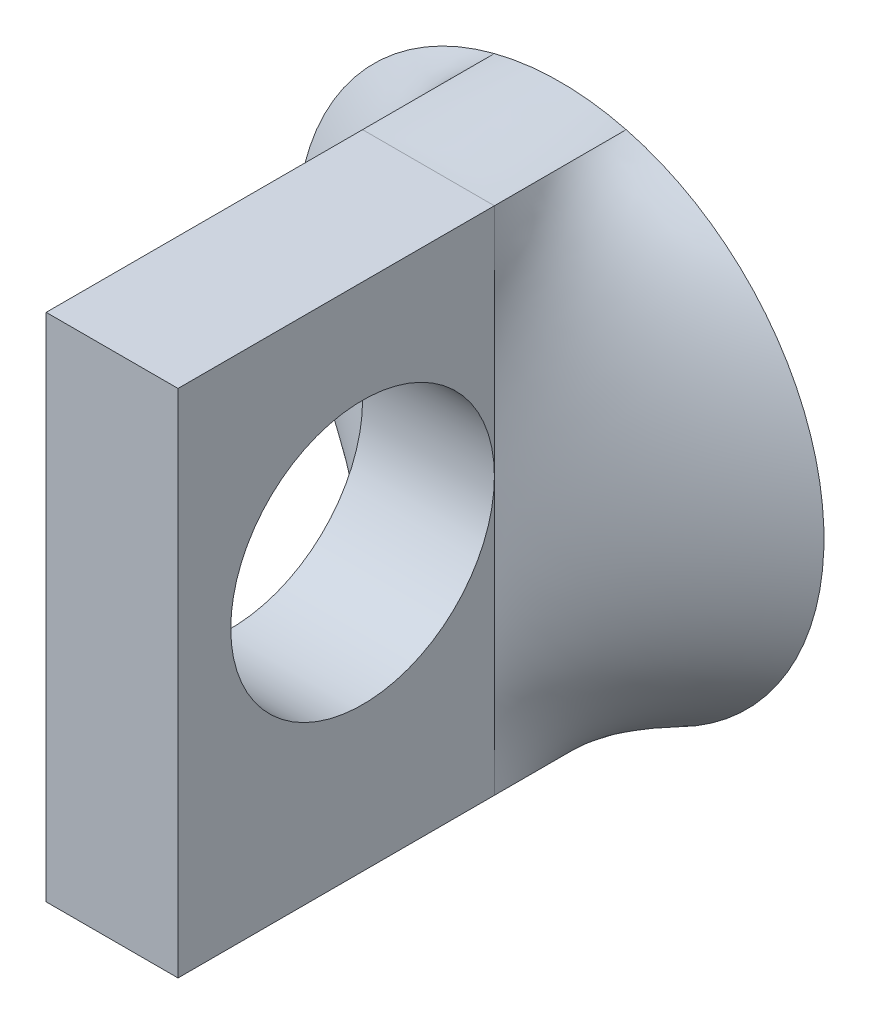
ISO-10303-21;
HEADER;
FILE_DESCRIPTION(('STEP AP214'),'2;1');
FILE_NAME('part.step','',(''),(''),'','','');
FILE_SCHEMA(('AUTOMOTIVE_DESIGN { 1 0 10303 214 1 1 1 1 }'));
ENDSEC;
DATA;
#1=APPLICATION_CONTEXT('core data for automotive mechanical design processes');
#2=APPLICATION_PROTOCOL_DEFINITION('international standard','automotive_design',2000,#1);
#3=PRODUCT_CONTEXT('',#1,'mechanical');
#4=PRODUCT('Part','Part','',(#3));
#5=PRODUCT_RELATED_PRODUCT_CATEGORY('part','',(#4));
#6=PRODUCT_DEFINITION_FORMATION('','',#4);
#7=PRODUCT_DEFINITION_CONTEXT('part definition',#1,'design');
#8=PRODUCT_DEFINITION('design','',#6,#7);
#9=PRODUCT_DEFINITION_SHAPE('','',#8);
#10=(LENGTH_UNIT() NAMED_UNIT(*) SI_UNIT(.MILLI.,.METRE.));
#11=(NAMED_UNIT(*) PLANE_ANGLE_UNIT() SI_UNIT($,.RADIAN.));
#12=(NAMED_UNIT(*) SI_UNIT($,.STERADIAN.) SOLID_ANGLE_UNIT());
#13=UNCERTAINTY_MEASURE_WITH_UNIT(LENGTH_MEASURE(1.E-05),#10,'distance_accuracy_value','');
#14=(GEOMETRIC_REPRESENTATION_CONTEXT(3) GLOBAL_UNCERTAINTY_ASSIGNED_CONTEXT((#13)) GLOBAL_UNIT_ASSIGNED_CONTEXT((#10,
#11,#12)) REPRESENTATION_CONTEXT('',''));
#15=CARTESIAN_POINT('',(0.,0.,0.));
#16=DIRECTION('',(0.,0.,1.));
#17=DIRECTION('',(1.,0.,0.));
#18=AXIS2_PLACEMENT_3D('',#15,#16,#17);
#19=CARTESIAN_POINT('',(0.,0.,0.));
#20=DIRECTION('',(0.,0.,1.));
#21=DIRECTION('',(1.,0.,0.));
#22=AXIS2_PLACEMENT_3D('',#19,#20,#21);
#23=PLANE('',#22);
#24=CARTESIAN_POINT('',(0.,0.,0.));
#25=DIRECTION('',(0.,0.,1.));
#26=DIRECTION('',(1.,0.,0.));
#27=AXIS2_PLACEMENT_3D('',#24,#25,#26);
#28=CIRCLE('',#27,12.7);
#29=CARTESIAN_POINT('',(3.175,12.2967221242085,0.));
#30=VERTEX_POINT('',#29);
#31=CARTESIAN_POINT('',(-3.175,12.2967221242086,0.));
#32=VERTEX_POINT('',#31);
#33=EDGE_CURVE('E356',#30,#32,#28,.T.);
#34=ORIENTED_EDGE('',*,*,#33,.F.);
#35=CARTESIAN_POINT('',(3.175,-12.2967221242086,0.));
#36=VERTEX_POINT('',#35);
#37=EDGE_CURVE('E147',#36,#30,#28,.T.);
#38=ORIENTED_EDGE('',*,*,#37,.F.);
#39=CARTESIAN_POINT('',(-3.17500000000001,-12.2967221242085,0.));
#40=VERTEX_POINT('',#39);
#41=EDGE_CURVE('E150',#40,#36,#28,.T.);
#42=ORIENTED_EDGE('',*,*,#41,.F.);
#43=EDGE_CURVE('E218',#32,#40,#28,.T.);
#44=ORIENTED_EDGE('',*,*,#43,.F.);
#45=EDGE_LOOP('',(#34,#38,#42,#44));
#46=FACE_BOUND('',#45,.T.);
#47=ADVANCED_FACE('F61',(#46),#23,.F.);
#48=CARTESIAN_POINT('',(-3.175,12.2967221242086,6.35));
#49=CARTESIAN_POINT('',(-3.175,12.2967221242086,0.));
#50=CARTESIAN_POINT('',(-2.11666666666667,12.2967221242086,6.35));
#51=CARTESIAN_POINT('',(-2.15027315631595,12.5613054575419,0.));
#52=CARTESIAN_POINT('',(-1.05833333333333,12.2967221242086,6.35));
#53=CARTESIAN_POINT('',(-1.0754076687772,12.7,0.));
#54=CARTESIAN_POINT('',(1.05833333333333,12.2967221242086,6.35));
#55=CARTESIAN_POINT('',(1.0754076687772,12.7,0.));
#56=CARTESIAN_POINT('',(2.11666666666667,12.2967221242086,6.35));
#57=CARTESIAN_POINT('',(2.15027315631595,12.5613054575419,0.));
#58=CARTESIAN_POINT('',(3.175,12.2967221242086,6.35));
#59=CARTESIAN_POINT('',(3.175,12.2967221242086,0.));
#60=B_SPLINE_SURFACE_WITH_KNOTS('',3,1,((#48,#49),(#50,#51),(#52,#53),(#54,#55),(#56,#57),(#58,
#59)),.UNSPECIFIED.,.F.,.F.,.F.,(4,2,4),(2,2),(0.,0.5,1.),(0.,1.),.UNSPECIFIED.);
#61=DIRECTION('',(-1.,0.,0.));
#62=VECTOR('',#61,1.);
#63=CARTESIAN_POINT('',(-3.175,12.2967221242086,6.35));
#64=LINE('',#63,#62);
#65=CARTESIAN_POINT('',(3.175,12.2967221242086,6.35));
#66=VERTEX_POINT('',#65);
#67=CARTESIAN_POINT('',(-3.175,12.2967221242086,6.35));
#68=VERTEX_POINT('',#67);
#69=EDGE_CURVE('E12',#66,#68,#64,.T.);
#70=DIRECTION('',(0.,0.,-1.));
#71=VECTOR('',#70,1.);
#72=CARTESIAN_POINT('',(3.175,12.2967221242086,3.175));
#73=LINE('',#72,#71);
#74=EDGE_CURVE('E275',#66,#30,#73,.T.);
#75=DIRECTION('',(0.,0.,1.));
#76=VECTOR('',#75,1.);
#77=CARTESIAN_POINT('',(-3.175,12.2967221242086,3.175));
#78=LINE('',#77,#76);
#79=EDGE_CURVE('E276',#32,#68,#78,.T.);
#80=ORIENTED_EDGE('',*,*,#69,.F.);
#81=ORIENTED_EDGE('',*,*,#74,.T.);
#82=ORIENTED_EDGE('',*,*,#33,.T.);
#83=ORIENTED_EDGE('',*,*,#79,.T.);
#84=EDGE_LOOP('',(#80,#81,#82,#83));
#85=FACE_BOUND('',#84,.T.);
#86=ADVANCED_FACE('F177',(#85),#60,.T.);
#87=CARTESIAN_POINT('',(3.175,12.2967221242086,6.35));
#88=CARTESIAN_POINT('',(3.175,12.2967221242085,0.));
#89=CARTESIAN_POINT('',(3.175,11.2719952805245,6.35));
#90=CARTESIAN_POINT('',(4.1671875,12.0405404132875,0.));
#91=CARTESIAN_POINT('',(3.175,10.2472684368405,6.35));
#92=CARTESIAN_POINT('',(5.22575770809678,11.6397656186062,0.));
#93=CARTESIAN_POINT('',(3.175,8.71017817131439,6.35));
#94=CARTESIAN_POINT('',(6.82310245436283,10.7289768718747,0.));
#95=CARTESIAN_POINT('',(3.175,8.19781474947237,6.35));
#96=CARTESIAN_POINT('',(7.35627303316777,10.3738281950702,0.));
#97=CARTESIAN_POINT('',(3.175,7.17308790578832,6.35));
#98=CARTESIAN_POINT('',(8.39815734657908,9.54997474035633,0.));
#99=CARTESIAN_POINT('',(3.175,6.6607244839463,6.35));
#100=CARTESIAN_POINT('',(8.90680529300567,9.08113316293158,0.));
#101=CARTESIAN_POINT('',(3.175,5.63599764026225,6.35));
#102=CARTESIAN_POINT('',(9.86710775047259,8.02734979248901,0.));
#103=CARTESIAN_POINT('',(3.175,5.12363421842023,6.35));
#104=CARTESIAN_POINT('',(10.3186115655806,7.44229688722872,0.));
#105=CARTESIAN_POINT('',(3.175,4.09890737473618,6.35));
#106=CARTESIAN_POINT('',(11.128650682258,6.16560310036806,0.));
#107=CARTESIAN_POINT('',(3.175,3.58654395289416,6.35));
#108=CARTESIAN_POINT('',(11.4869647263754,5.47393639825416,0.));
#109=CARTESIAN_POINT('',(3.175,2.56181710921011,6.35));
#110=CARTESIAN_POINT('',(12.0768906953114,4.00787343246087,0.));
#111=CARTESIAN_POINT('',(3.175,2.04945368736809,6.35));
#112=CARTESIAN_POINT('',(12.3082719090569,3.23358292105059,0.));
#113=CARTESIAN_POINT('',(3.175,1.02472684368405,6.35));
#114=CARTESIAN_POINT('',(12.6199014655561,1.6394215120723,0.));
#115=CARTESIAN_POINT('',(3.175,0.512363421842026,6.35));
#116=CARTESIAN_POINT('',(12.7,0.819781474947233,0.));
#117=CARTESIAN_POINT('',(3.175,-0.51236342184202,6.35));
#118=CARTESIAN_POINT('',(12.7,-0.819781474947238,0.));
#119=CARTESIAN_POINT('',(3.175,-1.02472684368405,6.35));
#120=CARTESIAN_POINT('',(12.6199014655561,-1.63942151207231,0.));
#121=CARTESIAN_POINT('',(3.175,-2.04945368736809,6.35));
#122=CARTESIAN_POINT('',(12.3082719090569,-3.23358292105059,0.));
#123=CARTESIAN_POINT('',(3.175,-2.56181710921012,6.35));
#124=CARTESIAN_POINT('',(12.0768906953114,-4.00787343246087,0.));
#125=CARTESIAN_POINT('',(3.175,-3.58654395289416,6.35));
#126=CARTESIAN_POINT('',(11.4869647263754,-5.47393639825416,0.));
#127=CARTESIAN_POINT('',(3.175,-4.09890737473618,6.35));
#128=CARTESIAN_POINT('',(11.128650682258,-6.16560310036806,0.));
#129=CARTESIAN_POINT('',(3.175,-5.12363421842023,6.35));
#130=CARTESIAN_POINT('',(10.3186115655806,-7.44229688722872,0.));
#131=CARTESIAN_POINT('',(3.175,-5.63599764026225,6.35));
#132=CARTESIAN_POINT('',(9.86710775047259,-8.02734979248901,0.));
#133=CARTESIAN_POINT('',(3.175,-6.6607244839463,6.35));
#134=CARTESIAN_POINT('',(8.90680529300567,-9.08113316293158,0.));
#135=CARTESIAN_POINT('',(3.175,-7.17308790578832,6.35));
#136=CARTESIAN_POINT('',(8.39815734657907,-9.54997474035634,0.));
#137=CARTESIAN_POINT('',(3.175,-8.19781474947237,6.35));
#138=CARTESIAN_POINT('',(7.35627303316776,-10.3738281950702,0.));
#139=CARTESIAN_POINT('',(3.175,-8.71017817131439,6.35));
#140=CARTESIAN_POINT('',(6.82310245436283,-10.7289768718747,0.));
#141=CARTESIAN_POINT('',(3.175,-10.2472684368405,6.35));
#142=CARTESIAN_POINT('',(5.22575770809677,-11.6397656186062,0.));
#143=CARTESIAN_POINT('',(3.175,-11.2719952805245,6.35));
#144=CARTESIAN_POINT('',(4.1671875,-12.0405404132875,0.));
#145=CARTESIAN_POINT('',(3.175,-12.2967221242085,6.35));
#146=CARTESIAN_POINT('',(3.175,-12.2967221242086,0.));
#147=B_SPLINE_SURFACE_WITH_KNOTS('',3,1,((#87,#88),(#89,#90),(#91,#92),(#93,#94),(#95,#96),(#97,
#98),(#99,#100),(#101,#102),(#103,#104),(#105,#106),(#107,#108),(#109,#110),(#111,#112),(#113,
#114),(#115,#116),(#117,#118),(#119,#120),(#121,#122),(#123,#124),(#125,#126),(#127,#128),(#129,
#130),(#131,#132),(#133,#134),(#135,#136),(#137,#138),(#139,#140),(#141,#142),(#143,#144),(#145,
#146)),.UNSPECIFIED.,.F.,.F.,.F.,(4,2,2,2,2,2,2,2,2,2,2,2,2,2,4),(2,2),(0.,0.125,0.1875,0.25,
0.3125,0.375,0.4375,0.5,0.5625,0.625,0.6875,0.75,0.8125,0.875,1.),(0.,1.),.UNSPECIFIED.);
#148=DIRECTION('',(0.,1.,0.));
#149=VECTOR('',#148,1.);
#150=CARTESIAN_POINT('',(3.175,12.2967221242086,6.35));
#151=LINE('',#150,#149);
#152=CARTESIAN_POINT('',(3.175,-12.2967221242086,6.35));
#153=VERTEX_POINT('',#152);
#154=CARTESIAN_POINT('',(3.175,1.01042885523128,6.35));
#155=VERTEX_POINT('',#154);
#156=EDGE_CURVE('E65',#153,#155,#151,.T.);
#157=DIRECTION('',(0.,0.,-1.));
#158=VECTOR('',#157,1.);
#159=CARTESIAN_POINT('',(3.175,-12.2967221242086,3.175));
#160=LINE('',#159,#158);
#161=EDGE_CURVE('E334',#153,#36,#160,.T.);
#162=EDGE_CURVE('E322',#155,#66,#151,.T.);
#163=ORIENTED_EDGE('',*,*,#156,.F.);
#164=ORIENTED_EDGE('',*,*,#161,.T.);
#165=ORIENTED_EDGE('',*,*,#37,.T.);
#166=ORIENTED_EDGE('',*,*,#74,.F.);
#167=ORIENTED_EDGE('',*,*,#162,.F.);
#168=EDGE_LOOP('',(#163,#164,#165,#166,#167));
#169=FACE_BOUND('',#168,.T.);
#170=ADVANCED_FACE('F185',(#169),#147,.T.);
#171=CARTESIAN_POINT('',(-3.175,-12.2967221242085,6.35));
#172=CARTESIAN_POINT('',(-3.175,-12.2967221242085,0.));
#173=CARTESIAN_POINT('',(-3.175,-11.2719952805245,6.35));
#174=CARTESIAN_POINT('',(-4.16718750000001,-12.0405404132875,0.));
#175=CARTESIAN_POINT('',(-3.175,-10.2472684368405,6.35));
#176=CARTESIAN_POINT('',(-5.22575770809678,-11.6397656186062,0.));
#177=CARTESIAN_POINT('',(-3.175,-8.71017817131439,6.35));
#178=CARTESIAN_POINT('',(-6.82310245436283,-10.7289768718747,0.));
#179=CARTESIAN_POINT('',(-3.175,-8.19781474947237,6.35));
#180=CARTESIAN_POINT('',(-7.35627303316776,-10.3738281950702,0.));
#181=CARTESIAN_POINT('',(-3.175,-7.17308790578832,6.35));
#182=CARTESIAN_POINT('',(-8.39815734657907,-9.54997474035633,0.));
#183=CARTESIAN_POINT('',(-3.175,-6.6607244839463,6.35));
#184=CARTESIAN_POINT('',(-8.90680529300567,-9.08113316293158,0.));
#185=CARTESIAN_POINT('',(-3.175,-5.63599764026226,6.35));
#186=CARTESIAN_POINT('',(-9.86710775047259,-8.02734979248901,0.));
#187=CARTESIAN_POINT('',(-3.175,-5.12363421842023,6.35));
#188=CARTESIAN_POINT('',(-10.3186115655806,-7.44229688722872,0.));
#189=CARTESIAN_POINT('',(-3.175,-4.09890737473619,6.35));
#190=CARTESIAN_POINT('',(-11.128650682258,-6.16560310036805,0.));
#191=CARTESIAN_POINT('',(-3.175,-3.58654395289417,6.35));
#192=CARTESIAN_POINT('',(-11.4869647263754,-5.47393639825415,0.));
#193=CARTESIAN_POINT('',(-3.175,-2.56181710921012,6.35));
#194=CARTESIAN_POINT('',(-12.0768906953114,-4.00787343246087,0.));
#195=CARTESIAN_POINT('',(-3.175,-2.0494536873681,6.35));
#196=CARTESIAN_POINT('',(-12.3082719090569,-3.23358292105058,0.));
#197=CARTESIAN_POINT('',(-3.175,-1.02472684368405,6.35));
#198=CARTESIAN_POINT('',(-12.6199014655561,-1.6394215120723,0.));
#199=CARTESIAN_POINT('',(-3.175,-0.512363421842032,6.35));
#200=CARTESIAN_POINT('',(-12.7,-0.819781474947232,0.));
#201=CARTESIAN_POINT('',(-3.175,0.512363421842013,6.35));
#202=CARTESIAN_POINT('',(-12.7,0.819781474947241,0.));
#203=CARTESIAN_POINT('',(-3.175,1.02472684368404,6.35));
#204=CARTESIAN_POINT('',(-12.6199014655561,1.63942151207231,0.));
#205=CARTESIAN_POINT('',(-3.175,2.04945368736808,6.35));
#206=CARTESIAN_POINT('',(-12.3082719090569,3.23358292105059,0.));
#207=CARTESIAN_POINT('',(-3.175,2.56181710921011,6.35));
#208=CARTESIAN_POINT('',(-12.0768906953114,4.00787343246087,0.));
#209=CARTESIAN_POINT('',(-3.175,3.58654395289415,6.35));
#210=CARTESIAN_POINT('',(-11.4869647263754,5.47393639825416,0.));
#211=CARTESIAN_POINT('',(-3.175,4.09890737473618,6.35));
#212=CARTESIAN_POINT('',(-11.128650682258,6.16560310036806,0.));
#213=CARTESIAN_POINT('',(-3.175,5.12363421842023,6.35));
#214=CARTESIAN_POINT('',(-10.3186115655806,7.44229688722873,0.));
#215=CARTESIAN_POINT('',(-3.175,5.63599764026225,6.35));
#216=CARTESIAN_POINT('',(-9.86710775047259,8.02734979248901,0.));
#217=CARTESIAN_POINT('',(-3.175,6.6607244839463,6.35));
#218=CARTESIAN_POINT('',(-8.90680529300567,9.08113316293158,0.));
#219=CARTESIAN_POINT('',(-3.175,7.17308790578832,6.35));
#220=CARTESIAN_POINT('',(-8.39815734657907,9.54997474035634,0.));
#221=CARTESIAN_POINT('',(-3.175,8.19781474947237,6.35));
#222=CARTESIAN_POINT('',(-7.35627303316776,10.3738281950702,0.));
#223=CARTESIAN_POINT('',(-3.175,8.71017817131439,6.35));
#224=CARTESIAN_POINT('',(-6.82310245436282,10.7289768718747,0.));
#225=CARTESIAN_POINT('',(-3.175,10.2472684368405,6.35));
#226=CARTESIAN_POINT('',(-5.22575770809677,11.6397656186062,0.));
#227=CARTESIAN_POINT('',(-3.175,11.2719952805245,6.35));
#228=CARTESIAN_POINT('',(-4.1671875,12.0405404132875,0.));
#229=CARTESIAN_POINT('',(-3.175,12.2967221242086,6.35));
#230=CARTESIAN_POINT('',(-3.175,12.2967221242086,0.));
#231=B_SPLINE_SURFACE_WITH_KNOTS('',3,1,((#171,#172),(#173,#174),(#175,#176),(#177,#178),(#179,
#180),(#181,#182),(#183,#184),(#185,#186),(#187,#188),(#189,#190),(#191,#192),(#193,#194),(#195,
#196),(#197,#198),(#199,#200),(#201,#202),(#203,#204),(#205,#206),(#207,#208),(#209,#210),(#211,
#212),(#213,#214),(#215,#216),(#217,#218),(#219,#220),(#221,#222),(#223,#224),(#225,#226),(#227,
#228),(#229,#230)),.UNSPECIFIED.,.F.,.F.,.F.,(4,2,2,2,2,2,2,2,2,2,2,2,2,2,4),(2,2),(0.,0.125,
0.1875,0.25,0.3125,0.375,0.4375,0.5,0.5625,0.625,0.6875,0.75,0.8125,0.875,1.),(0.,1.),.UNSPECIFIED.);
#232=DIRECTION('',(0.,-1.,0.));
#233=VECTOR('',#232,1.);
#234=CARTESIAN_POINT('',(-3.175,12.2967221242086,6.35));
#235=LINE('',#234,#233);
#236=CARTESIAN_POINT('',(-3.175,1.01042885523128,6.35));
#237=VERTEX_POINT('',#236);
#238=EDGE_CURVE('E71',#68,#237,#235,.T.);
#239=DIRECTION('',(0.,0.,-1.));
#240=VECTOR('',#239,1.);
#241=CARTESIAN_POINT('',(-3.175,-12.2967221242086,3.175));
#242=LINE('',#241,#240);
#243=CARTESIAN_POINT('',(-3.175,-12.2967221242086,6.35));
#244=VERTEX_POINT('',#243);
#245=EDGE_CURVE('E343',#244,#40,#242,.T.);
#246=EDGE_CURVE('E257',#237,#244,#235,.T.);
#247=ORIENTED_EDGE('',*,*,#238,.F.);
#248=ORIENTED_EDGE('',*,*,#79,.F.);
#249=ORIENTED_EDGE('',*,*,#43,.T.);
#250=ORIENTED_EDGE('',*,*,#245,.F.);
#251=ORIENTED_EDGE('',*,*,#246,.F.);
#252=EDGE_LOOP('',(#247,#248,#249,#250,#251));
#253=FACE_BOUND('',#252,.T.);
#254=ADVANCED_FACE('F224',(#253),#231,.T.);
#255=CARTESIAN_POINT('',(3.175,-12.2967221242086,6.35));
#256=CARTESIAN_POINT('',(3.175,-12.2967221242086,0.));
#257=CARTESIAN_POINT('',(2.11666666666667,-12.2967221242086,6.35));
#258=CARTESIAN_POINT('',(2.15027315631595,-12.5613054575419,0.));
#259=CARTESIAN_POINT('',(1.05833333333334,-12.2967221242086,6.35));
#260=CARTESIAN_POINT('',(1.0754076687772,-12.7,0.));
#261=CARTESIAN_POINT('',(-1.05833333333333,-12.2967221242086,6.35));
#262=CARTESIAN_POINT('',(-1.07540766877721,-12.7,0.));
#263=CARTESIAN_POINT('',(-2.11666666666666,-12.2967221242086,6.35));
#264=CARTESIAN_POINT('',(-2.15027315631596,-12.5613054575419,0.));
#265=CARTESIAN_POINT('',(-3.175,-12.2967221242086,6.35));
#266=CARTESIAN_POINT('',(-3.17500000000001,-12.2967221242085,0.));
#267=B_SPLINE_SURFACE_WITH_KNOTS('',3,1,((#255,#256),(#257,#258),(#259,#260),(#261,#262),(#263,
#264),(#265,#266)),.UNSPECIFIED.,.F.,.F.,.F.,(4,2,4),(2,2),(0.,0.5,1.),(0.,1.),.UNSPECIFIED.);
#268=DIRECTION('',(1.,0.,0.));
#269=VECTOR('',#268,1.);
#270=CARTESIAN_POINT('',(-3.175,-12.2967221242086,6.35));
#271=LINE('',#270,#269);
#272=EDGE_CURVE('E145',#244,#153,#271,.T.);
#273=ORIENTED_EDGE('',*,*,#272,.F.);
#274=ORIENTED_EDGE('',*,*,#245,.T.);
#275=ORIENTED_EDGE('',*,*,#41,.T.);
#276=ORIENTED_EDGE('',*,*,#161,.F.);
#277=EDGE_LOOP('',(#273,#274,#275,#276));
#278=FACE_BOUND('',#277,.T.);
#279=ADVANCED_FACE('F176',(#278),#267,.T.);
#280=CARTESIAN_POINT('',(-3.175,-12.2967221242086,21.59));
#281=DIRECTION('',(0.,1.,0.));
#282=DIRECTION('',(0.,0.,1.));
#283=AXIS2_PLACEMENT_3D('',#280,#281,#282);
#284=PLANE('',#283);
#285=ORIENTED_EDGE('',*,*,#272,.T.);
#286=DIRECTION('',(0.,0.,-1.));
#287=VECTOR('',#286,1.);
#288=CARTESIAN_POINT('',(3.175,-12.2967221242086,21.59));
#289=LINE('',#288,#287);
#290=CARTESIAN_POINT('',(3.175,-12.2967221242086,21.59));
#291=VERTEX_POINT('',#290);
#292=EDGE_CURVE('E126',#291,#153,#289,.T.);
#293=ORIENTED_EDGE('',*,*,#292,.F.);
#294=DIRECTION('',(1.,0.,0.));
#295=VECTOR('',#294,1.);
#296=CARTESIAN_POINT('',(-3.175,-12.2967221242086,21.59));
#297=LINE('',#296,#295);
#298=CARTESIAN_POINT('',(-3.175,-12.2967221242086,21.59));
#299=VERTEX_POINT('',#298);
#300=EDGE_CURVE('E133',#299,#291,#297,.T.);
#301=ORIENTED_EDGE('',*,*,#300,.F.);
#302=DIRECTION('',(0.,0.,-1.));
#303=VECTOR('',#302,1.);
#304=CARTESIAN_POINT('',(-3.175,-12.2967221242086,21.59));
#305=LINE('',#304,#303);
#306=EDGE_CURVE('E270',#299,#244,#305,.T.);
#307=ORIENTED_EDGE('',*,*,#306,.T.);
#308=EDGE_LOOP('',(#285,#293,#301,#307));
#309=FACE_BOUND('',#308,.T.);
#310=ADVANCED_FACE('F143',(#309),#284,.F.);
#311=CARTESIAN_POINT('',(3.175,-12.2967221242086,21.59));
#312=DIRECTION('',(-1.,0.,0.));
#313=DIRECTION('',(0.,0.,1.));
#314=AXIS2_PLACEMENT_3D('',#311,#312,#313);
#315=PLANE('',#314);
#316=ORIENTED_EDGE('',*,*,#156,.T.);
#317=CARTESIAN_POINT('',(3.175,1.01042885523128,12.7));
#318=DIRECTION('',(1.,0.,0.));
#319=DIRECTION('',(0.,0.,-1.));
#320=AXIS2_PLACEMENT_3D('',#317,#318,#319);
#321=CIRCLE('',#320,6.35);
#322=EDGE_CURVE('E77',#155,#155,#321,.T.);
#323=ORIENTED_EDGE('',*,*,#322,.F.);
#324=ORIENTED_EDGE('',*,*,#162,.T.);
#325=DIRECTION('',(0.,0.,-1.));
#326=VECTOR('',#325,1.);
#327=CARTESIAN_POINT('',(3.175,12.2967221242086,21.59));
#328=LINE('',#327,#326);
#329=CARTESIAN_POINT('',(3.175,12.2967221242086,21.59));
#330=VERTEX_POINT('',#329);
#331=EDGE_CURVE('E129',#330,#66,#328,.T.);
#332=ORIENTED_EDGE('',*,*,#331,.F.);
#333=DIRECTION('',(0.,1.,0.));
#334=VECTOR('',#333,1.);
#335=CARTESIAN_POINT('',(3.175,-12.2967221242086,21.59));
#336=LINE('',#335,#334);
#337=EDGE_CURVE('E121',#291,#330,#336,.T.);
#338=ORIENTED_EDGE('',*,*,#337,.F.);
#339=ORIENTED_EDGE('',*,*,#292,.T.);
#340=EDGE_LOOP('',(#316,#323,#324,#332,#338,#339));
#341=FACE_BOUND('',#340,.T.);
#342=ADVANCED_FACE('F124',(#341),#315,.F.);
#343=CARTESIAN_POINT('',(3.175,12.2967221242086,21.59));
#344=DIRECTION('',(0.,-1.,0.));
#345=DIRECTION('',(0.,0.,-1.));
#346=AXIS2_PLACEMENT_3D('',#343,#344,#345);
#347=PLANE('',#346);
#348=ORIENTED_EDGE('',*,*,#69,.T.);
#349=DIRECTION('',(0.,0.,-1.));
#350=VECTOR('',#349,1.);
#351=CARTESIAN_POINT('',(-3.175,12.2967221242086,21.59));
#352=LINE('',#351,#350);
#353=CARTESIAN_POINT('',(-3.175,12.2967221242086,21.59));
#354=VERTEX_POINT('',#353);
#355=EDGE_CURVE('E152',#354,#68,#352,.T.);
#356=ORIENTED_EDGE('',*,*,#355,.F.);
#357=DIRECTION('',(-1.,0.,0.));
#358=VECTOR('',#357,1.);
#359=CARTESIAN_POINT('',(3.175,12.2967221242086,21.59));
#360=LINE('',#359,#358);
#361=EDGE_CURVE('E132',#330,#354,#360,.T.);
#362=ORIENTED_EDGE('',*,*,#361,.F.);
#363=ORIENTED_EDGE('',*,*,#331,.T.);
#364=EDGE_LOOP('',(#348,#356,#362,#363));
#365=FACE_BOUND('',#364,.T.);
#366=ADVANCED_FACE('F281',(#365),#347,.F.);
#367=CARTESIAN_POINT('',(-3.175,12.2967221242086,21.59));
#368=DIRECTION('',(1.,0.,0.));
#369=DIRECTION('',(0.,0.,-1.));
#370=AXIS2_PLACEMENT_3D('',#367,#368,#369);
#371=PLANE('',#370);
#372=ORIENTED_EDGE('',*,*,#238,.T.);
#373=CARTESIAN_POINT('',(-3.175,1.01042885523128,12.7));
#374=DIRECTION('',(1.,0.,0.));
#375=DIRECTION('',(0.,0.,-1.));
#376=AXIS2_PLACEMENT_3D('',#373,#374,#375);
#377=CIRCLE('',#376,6.35);
#378=EDGE_CURVE('E82',#237,#237,#377,.T.);
#379=ORIENTED_EDGE('',*,*,#378,.T.);
#380=ORIENTED_EDGE('',*,*,#246,.T.);
#381=ORIENTED_EDGE('',*,*,#306,.F.);
#382=DIRECTION('',(0.,-1.,0.));
#383=VECTOR('',#382,1.);
#384=CARTESIAN_POINT('',(-3.175,12.2967221242086,21.59));
#385=LINE('',#384,#383);
#386=EDGE_CURVE('E138',#354,#299,#385,.T.);
#387=ORIENTED_EDGE('',*,*,#386,.F.);
#388=ORIENTED_EDGE('',*,*,#355,.T.);
#389=EDGE_LOOP('',(#372,#379,#380,#381,#387,#388));
#390=FACE_BOUND('',#389,.T.);
#391=ADVANCED_FACE('F284',(#390),#371,.F.);
#392=CARTESIAN_POINT('',(3.175,-12.2967221242086,21.59));
#393=DIRECTION('',(0.,0.,1.));
#394=DIRECTION('',(1.,0.,0.));
#395=AXIS2_PLACEMENT_3D('',#392,#393,#394);
#396=PLANE('',#395);
#397=ORIENTED_EDGE('',*,*,#300,.T.);
#398=ORIENTED_EDGE('',*,*,#337,.T.);
#399=ORIENTED_EDGE('',*,*,#361,.T.);
#400=ORIENTED_EDGE('',*,*,#386,.T.);
#401=EDGE_LOOP('',(#397,#398,#399,#400));
#402=FACE_BOUND('',#401,.T.);
#403=ADVANCED_FACE('F136',(#402),#396,.T.);
#404=CARTESIAN_POINT('',(-12.7049742244951,1.01042885523128,12.7));
#405=DIRECTION('',(1.,0.,0.));
#406=DIRECTION('',(0.,0.,-1.));
#407=AXIS2_PLACEMENT_3D('',#404,#405,#406);
#408=CYLINDRICAL_SURFACE('',#407,6.35);
#409=ORIENTED_EDGE('',*,*,#322,.T.);
#410=EDGE_LOOP('',(#409));
#411=FACE_BOUND('',#410,.T.);
#412=ORIENTED_EDGE('',*,*,#378,.F.);
#413=EDGE_LOOP('',(#412));
#414=FACE_BOUND('',#413,.T.);
#415=ADVANCED_FACE('F442',(#411,#414),#408,.F.);
#416=CLOSED_SHELL('',(#47,#86,#170,#254,#279,#310,#342,#366,#391,#403,#415));
#417=MANIFOLD_SOLID_BREP('B2',#416);
#418=ADVANCED_BREP_SHAPE_REPRESENTATION('',(#18,#417),#14);
#419=SHAPE_DEFINITION_REPRESENTATION(#9,#418);
ENDSEC;
END-ISO-10303-21;
